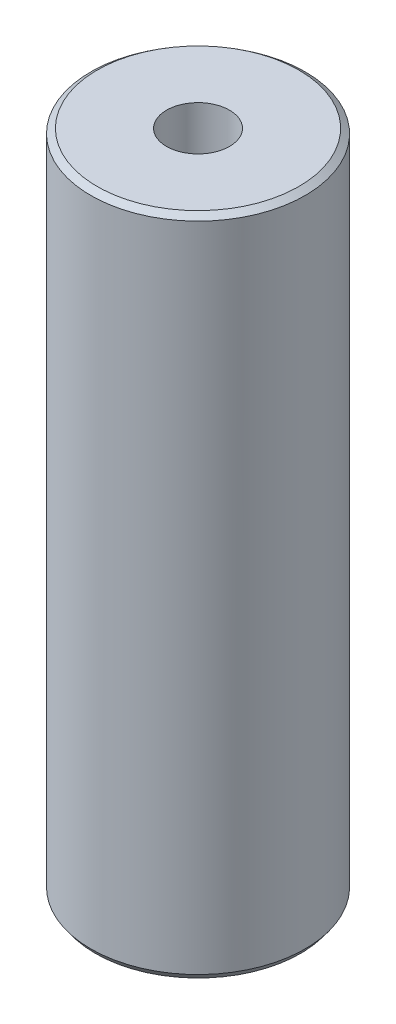
ISO-10303-21;
HEADER;
FILE_DESCRIPTION(('STEP AP214'),'2;1');
FILE_NAME('part.step','',(''),(''),'','','');
FILE_SCHEMA(('AUTOMOTIVE_DESIGN { 1 0 10303 214 1 1 1 1 }'));
ENDSEC;
DATA;
#1=APPLICATION_CONTEXT('core data for automotive mechanical design processes');
#2=APPLICATION_PROTOCOL_DEFINITION('international standard','automotive_design',2000,#1);
#3=PRODUCT_CONTEXT('',#1,'mechanical');
#4=PRODUCT('Part','Part','',(#3));
#5=PRODUCT_RELATED_PRODUCT_CATEGORY('part','',(#4));
#6=PRODUCT_DEFINITION_FORMATION('','',#4);
#7=PRODUCT_DEFINITION_CONTEXT('part definition',#1,'design');
#8=PRODUCT_DEFINITION('design','',#6,#7);
#9=PRODUCT_DEFINITION_SHAPE('','',#8);
#10=(LENGTH_UNIT() NAMED_UNIT(*) SI_UNIT(.MILLI.,.METRE.));
#11=(NAMED_UNIT(*) PLANE_ANGLE_UNIT() SI_UNIT($,.RADIAN.));
#12=(NAMED_UNIT(*) SI_UNIT($,.STERADIAN.) SOLID_ANGLE_UNIT());
#13=UNCERTAINTY_MEASURE_WITH_UNIT(LENGTH_MEASURE(1.E-05),#10,'distance_accuracy_value','');
#14=(GEOMETRIC_REPRESENTATION_CONTEXT(3) GLOBAL_UNCERTAINTY_ASSIGNED_CONTEXT((#13)) GLOBAL_UNIT_ASSIGNED_CONTEXT((#10,
#11,#12)) REPRESENTATION_CONTEXT('',''));
#15=CARTESIAN_POINT('',(0.,0.,0.));
#16=DIRECTION('',(0.,0.,1.));
#17=DIRECTION('',(1.,0.,0.));
#18=AXIS2_PLACEMENT_3D('',#15,#16,#17);
#19=CARTESIAN_POINT('',(0.,340.4497119485,0.));
#20=DIRECTION('',(0.,-1.,0.));
#21=DIRECTION('',(0.,0.,-1.));
#22=AXIS2_PLACEMENT_3D('',#19,#20,#21);
#23=CYLINDRICAL_SURFACE('',#22,55.);
#24=CARTESIAN_POINT('',(0.,338.067699418395,0.));
#25=DIRECTION('',(0.,1.,0.));
#26=DIRECTION('',(0.,0.,1.));
#27=AXIS2_PLACEMENT_3D('',#24,#25,#26);
#28=CIRCLE('',#27,55.);
#29=CARTESIAN_POINT('',(0.,338.067699418395,-55.));
#30=VERTEX_POINT('',#29);
#31=EDGE_CURVE('E50',#30,#30,#28,.F.);
#32=ORIENTED_EDGE('',*,*,#31,.T.);
#33=EDGE_LOOP('',(#32));
#34=FACE_BOUND('',#33,.T.);
#35=CARTESIAN_POINT('',(0.,3.2388509033015,0.));
#36=DIRECTION('',(0.,1.,0.));
#37=DIRECTION('',(0.,0.,1.));
#38=AXIS2_PLACEMENT_3D('',#35,#36,#37);
#39=CIRCLE('',#38,55.);
#40=CARTESIAN_POINT('',(0.,3.2388509033015,55.));
#41=VERTEX_POINT('',#40);
#42=EDGE_CURVE('E51',#41,#41,#39,.T.);
#43=ORIENTED_EDGE('',*,*,#42,.T.);
#44=EDGE_LOOP('',(#43));
#45=FACE_BOUND('',#44,.T.);
#46=ADVANCED_FACE('F39',(#34,#45),#23,.T.);
#47=CARTESIAN_POINT('',(0.,340.4497119485,0.));
#48=DIRECTION('',(0.,1.,0.));
#49=DIRECTION('',(0.,0.,1.));
#50=AXIS2_PLACEMENT_3D('',#47,#48,#49);
#51=PLANE('',#50);
#52=CARTESIAN_POINT('',(0.,340.4497119485,0.));
#53=DIRECTION('',(0.,1.,0.));
#54=DIRECTION('',(0.,0.,1.));
#55=AXIS2_PLACEMENT_3D('',#52,#53,#54);
#56=CIRCLE('',#55,51.7611490966986);
#57=CARTESIAN_POINT('',(0.,340.4497119485,-51.7611490966986));
#58=VERTEX_POINT('',#57);
#59=EDGE_CURVE('E54',#58,#58,#56,.T.);
#60=ORIENTED_EDGE('',*,*,#59,.T.);
#61=EDGE_LOOP('',(#60));
#62=FACE_BOUND('',#61,.T.);
#63=CARTESIAN_POINT('',(0.,340.4497119485,0.));
#64=DIRECTION('',(0.,1.,0.));
#65=DIRECTION('',(0.,0.,1.));
#66=AXIS2_PLACEMENT_3D('',#63,#64,#65);
#67=CIRCLE('',#66,16.1534647063915);
#68=CARTESIAN_POINT('',(0.,340.4497119485,16.1534647063915));
#69=VERTEX_POINT('',#68);
#70=EDGE_CURVE('E58',#69,#69,#67,.T.);
#71=ORIENTED_EDGE('',*,*,#70,.F.);
#72=EDGE_LOOP('',(#71));
#73=FACE_BOUND('',#72,.T.);
#74=ADVANCED_FACE('F69',(#62,#73),#51,.T.);
#75=CARTESIAN_POINT('',(0.,0.,0.));
#76=DIRECTION('',(0.,1.,0.));
#77=DIRECTION('',(0.,0.,1.));
#78=AXIS2_PLACEMENT_3D('',#75,#76,#77);
#79=PLANE('',#78);
#80=CARTESIAN_POINT('',(0.,0.,0.));
#81=DIRECTION('',(0.,1.,0.));
#82=DIRECTION('',(0.,0.,1.));
#83=AXIS2_PLACEMENT_3D('',#80,#81,#82);
#84=CIRCLE('',#83,52.6179874698947);
#85=CARTESIAN_POINT('',(0.,0.,52.6179874698947));
#86=VERTEX_POINT('',#85);
#87=EDGE_CURVE('E10',#86,#86,#84,.F.);
#88=ORIENTED_EDGE('',*,*,#87,.T.);
#89=EDGE_LOOP('',(#88));
#90=FACE_BOUND('',#89,.T.);
#91=CARTESIAN_POINT('',(0.,0.,0.));
#92=DIRECTION('',(0.,1.,0.));
#93=DIRECTION('',(0.,0.,1.));
#94=AXIS2_PLACEMENT_3D('',#91,#92,#93);
#95=CIRCLE('',#94,16.1534647063915);
#96=CARTESIAN_POINT('',(0.,0.,16.1534647063915));
#97=VERTEX_POINT('',#96);
#98=EDGE_CURVE('E63',#97,#97,#95,.T.);
#99=ORIENTED_EDGE('',*,*,#98,.T.);
#100=EDGE_LOOP('',(#99));
#101=FACE_BOUND('',#100,.T.);
#102=ADVANCED_FACE('F75',(#90,#101),#79,.F.);
#103=CARTESIAN_POINT('',(0.,340.4497119485,0.));
#104=DIRECTION('',(0.,-1.,0.));
#105=DIRECTION('',(0.,0.,-1.));
#106=AXIS2_PLACEMENT_3D('',#103,#104,#105);
#107=CYLINDRICAL_SURFACE('',#106,16.1534647063915);
#108=ORIENTED_EDGE('',*,*,#70,.T.);
#109=EDGE_LOOP('',(#108));
#110=FACE_BOUND('',#109,.T.);
#111=ORIENTED_EDGE('',*,*,#98,.F.);
#112=EDGE_LOOP('',(#111));
#113=FACE_BOUND('',#112,.T.);
#114=ADVANCED_FACE('F70',(#110,#113),#107,.F.);
#115=CARTESIAN_POINT('',(0.,340.4497119485,0.));
#116=DIRECTION('',(0.,-1.,0.));
#117=DIRECTION('',(0.,0.,-1.));
#118=AXIS2_PLACEMENT_3D('',#115,#116,#117);
#119=CONICAL_SURFACE('',#118,51.7611490966986,0.936672509027958);
#120=CARTESIAN_POINT('',(0.,338.067699418395,-55.));
#121=CARTESIAN_POINT('',(0.,338.092512048917,-54.9662619697573));
#122=CARTESIAN_POINT('',(0.,338.117324679439,-54.9325239395146));
#123=CARTESIAN_POINT('',(0.,338.166949940483,-54.8650478790291));
#124=CARTESIAN_POINT('',(0.,338.191762571005,-54.8313098487864));
#125=CARTESIAN_POINT('',(0.,338.241387832048,-54.763833788301));
#126=CARTESIAN_POINT('',(0.,338.26620046257,-54.7300957580583));
#127=CARTESIAN_POINT('',(0.,338.315825723614,-54.6626196975728));
#128=CARTESIAN_POINT('',(0.,338.340638354136,-54.6288816673301));
#129=CARTESIAN_POINT('',(0.,338.39026361518,-54.5614056068446));
#130=CARTESIAN_POINT('',(0.,338.415076245702,-54.5276675766019));
#131=CARTESIAN_POINT('',(0.,338.464701506746,-54.4601915161165));
#132=CARTESIAN_POINT('',(0.,338.489514137268,-54.4264534858738));
#133=CARTESIAN_POINT('',(0.,338.539139398312,-54.3589774253883));
#134=CARTESIAN_POINT('',(0.,338.563952028834,-54.3252393951456));
#135=CARTESIAN_POINT('',(0.,338.613577289877,-54.2577633346601));
#136=CARTESIAN_POINT('',(0.,338.638389920399,-54.2240253044174));
#137=CARTESIAN_POINT('',(0.,338.688015181443,-54.156549243932));
#138=CARTESIAN_POINT('',(0.,338.712827811965,-54.1228112136892));
#139=CARTESIAN_POINT('',(0.,338.762453073009,-54.0553351532038));
#140=CARTESIAN_POINT('',(0.,338.787265703531,-54.0215971229611));
#141=CARTESIAN_POINT('',(0.,338.836890964575,-53.9541210624756));
#142=CARTESIAN_POINT('',(0.,338.861703595097,-53.9203830322329));
#143=CARTESIAN_POINT('',(0.,338.911328856141,-53.8529069717475));
#144=CARTESIAN_POINT('',(0.,338.936141486663,-53.8191689415047));
#145=CARTESIAN_POINT('',(0.,338.985766747706,-53.7516928810193));
#146=CARTESIAN_POINT('',(0.,339.010579378228,-53.7179548507766));
#147=CARTESIAN_POINT('',(0.,339.060204639272,-53.6504787902911));
#148=CARTESIAN_POINT('',(0.,339.085017269794,-53.6167407600484));
#149=CARTESIAN_POINT('',(0.,339.134642530838,-53.549264699563));
#150=CARTESIAN_POINT('',(0.,339.15945516136,-53.5155266693202));
#151=CARTESIAN_POINT('',(0.,339.209080422404,-53.4480506088348));
#152=CARTESIAN_POINT('',(0.,339.233893052926,-53.4143125785921));
#153=CARTESIAN_POINT('',(0.,339.28351831397,-53.3468365181066));
#154=CARTESIAN_POINT('',(0.,339.308330944491,-53.3130984878639));
#155=CARTESIAN_POINT('',(0.,339.357956205535,-53.2456224273784));
#156=CARTESIAN_POINT('',(0.,339.382768836057,-53.2118843971357));
#157=CARTESIAN_POINT('',(0.,339.432394097101,-53.1444083366503));
#158=CARTESIAN_POINT('',(0.,339.457206727623,-53.1106703064076));
#159=CARTESIAN_POINT('',(0.,339.506831988667,-53.0431942459221));
#160=CARTESIAN_POINT('',(0.,339.531644619189,-53.0094562156794));
#161=CARTESIAN_POINT('',(0.,339.581269880233,-52.9419801551939));
#162=CARTESIAN_POINT('',(0.,339.606082510755,-52.9082421249512));
#163=CARTESIAN_POINT('',(0.,339.655707771798,-52.8407660644658));
#164=CARTESIAN_POINT('',(0.,339.68052040232,-52.807028034223));
#165=CARTESIAN_POINT('',(0.,339.730145663364,-52.7395519737376));
#166=CARTESIAN_POINT('',(0.,339.754958293886,-52.7058139434949));
#167=CARTESIAN_POINT('',(0.,339.80458355493,-52.6383378830094));
#168=CARTESIAN_POINT('',(0.,339.829396185452,-52.6045998527667));
#169=CARTESIAN_POINT('',(0.,339.879021446496,-52.5371237922813));
#170=CARTESIAN_POINT('',(0.,339.903834077018,-52.5033857620385));
#171=CARTESIAN_POINT('',(0.,339.953459338062,-52.4359097015531));
#172=CARTESIAN_POINT('',(0.,339.978271968584,-52.4021716713104));
#173=CARTESIAN_POINT('',(0.,340.027897229627,-52.3346956108249));
#174=CARTESIAN_POINT('',(0.,340.052709860149,-52.3009575805822));
#175=CARTESIAN_POINT('',(0.,340.102335121193,-52.2334815200968));
#176=CARTESIAN_POINT('',(0.,340.127147751715,-52.199743489854));
#177=CARTESIAN_POINT('',(0.,340.176773012759,-52.1322674293686));
#178=CARTESIAN_POINT('',(0.,340.201585643281,-52.0985293991259));
#179=CARTESIAN_POINT('',(0.,340.251210904325,-52.0310533386404));
#180=CARTESIAN_POINT('',(0.,340.276023534847,-51.9973153083977));
#181=CARTESIAN_POINT('',(0.,340.325648795891,-51.9298392479122));
#182=CARTESIAN_POINT('',(0.,340.350461426412,-51.8961012176695));
#183=CARTESIAN_POINT('',(0.,340.400086687456,-51.8286251571841));
#184=CARTESIAN_POINT('',(0.,340.424899317978,-51.7948871269414));
#185=CARTESIAN_POINT('',(0.,340.4497119485,-51.7611490966986));
#186=B_SPLINE_CURVE_WITH_KNOTS('',3,(#120,#121,#122,#123,#124,#125,#126,#127,#128,#129,#130,
#131,#132,#133,#134,#135,#136,#137,#138,#139,#140,#141,#142,#143,#144,#145,#146,#147,#148,#149,
#150,#151,#152,#153,#154,#155,#156,#157,#158,#159,#160,#161,#162,#163,#164,#165,#166,#167,#168,
#169,#170,#171,#172,#173,#174,#175,#176,#177,#178,#179,#180,#181,#182,#183,#184,#185),
.UNSPECIFIED.,.F.,.F.,(4,2,2,2,2,2,2,2,2,2,2,2,2,2,2,2,2,2,2,2,2,2,2,2,2,2,2,2,2,2,2,2,4),(0.,
0.125639531448874,0.251279062897749,0.376918594346623,0.502558125795459,0.628197657244333,
0.753837188693207,0.879476720142081,1.00511625159092,1.13075578303979,1.25639531448867,
1.38203484593754,1.50767437738638,1.63331390883526,1.75895344028412,1.884592971733,
2.01023250318184,2.13587203463071,2.26151156607959,2.38715109752846,2.5127906289773,
2.63843016042617,2.76406969187505,2.88970922332392,3.01534875477276,3.14098828622163,
3.26662781767051,3.39226734911938,3.51790688056825,3.64354641201709,3.76918594346597,
3.89482547491484,4.02046500636371),.UNSPECIFIED.);
#187=EDGE_CURVE('BSEAM81',#30,#58,#186,.T.);
#188=ORIENTED_EDGE('',*,*,#31,.F.);
#189=ORIENTED_EDGE('',*,*,#59,.F.);
#190=ORIENTED_EDGE('',*,*,#187,.T.);
#191=ORIENTED_EDGE('',*,*,#187,.F.);
#192=EDGE_LOOP('',(#188,#190,#189,#191));
#193=FACE_BOUND('',#192,.T.);
#194=ADVANCED_FACE('F81',(#193),#119,.T.);
#195=CARTESIAN_POINT('',(0.,3.2388509033015,0.));
#196=DIRECTION('',(0.,1.,0.));
#197=DIRECTION('',(0.,0.,1.));
#198=AXIS2_PLACEMENT_3D('',#195,#196,#197);
#199=CONICAL_SURFACE('',#198,55.,0.634123817766936);
#200=ORIENTED_EDGE('',*,*,#87,.F.);
#201=EDGE_LOOP('',(#200));
#202=FACE_BOUND('',#201,.T.);
#203=ORIENTED_EDGE('',*,*,#42,.F.);
#204=EDGE_LOOP('',(#203));
#205=FACE_BOUND('',#204,.T.);
#206=ADVANCED_FACE('F45',(#202,#205),#199,.T.);
#207=CLOSED_SHELL('',(#46,#74,#102,#114,#194,#206));
#208=MANIFOLD_SOLID_BREP('B2',#207);
#209=ADVANCED_BREP_SHAPE_REPRESENTATION('',(#18,#208),#14);
#210=SHAPE_DEFINITION_REPRESENTATION(#9,#209);
ENDSEC;
END-ISO-10303-21;
